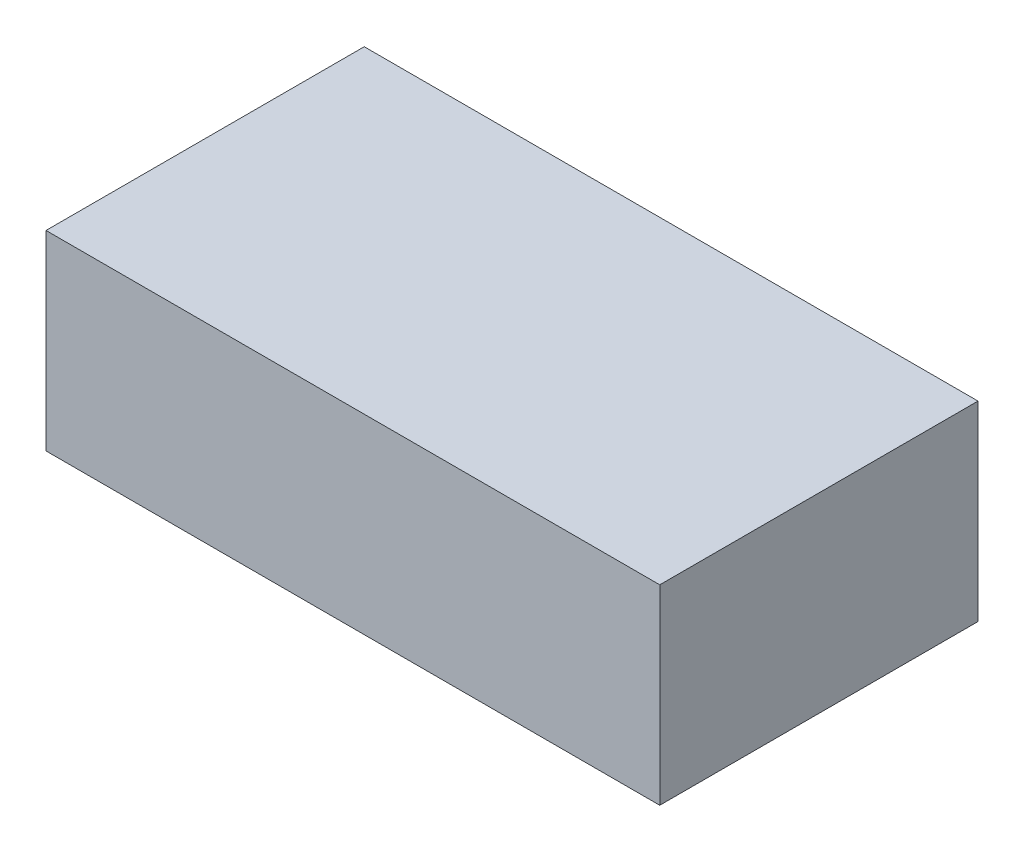
ISO-10303-21;
HEADER;
FILE_DESCRIPTION(('STEP AP214'),'2;1');
FILE_NAME('part.step','',(''),(''),'','','');
FILE_SCHEMA(('AUTOMOTIVE_DESIGN { 1 0 10303 214 1 1 1 1 }'));
ENDSEC;
DATA;
#1=APPLICATION_CONTEXT('core data for automotive mechanical design processes');
#2=APPLICATION_PROTOCOL_DEFINITION('international standard','automotive_design',2000,#1);
#3=PRODUCT_CONTEXT('',#1,'mechanical');
#4=PRODUCT('Part','Part','',(#3));
#5=PRODUCT_RELATED_PRODUCT_CATEGORY('part','',(#4));
#6=PRODUCT_DEFINITION_FORMATION('','',#4);
#7=PRODUCT_DEFINITION_CONTEXT('part definition',#1,'design');
#8=PRODUCT_DEFINITION('design','',#6,#7);
#9=PRODUCT_DEFINITION_SHAPE('','',#8);
#10=(LENGTH_UNIT() NAMED_UNIT(*) SI_UNIT(.MILLI.,.METRE.));
#11=(NAMED_UNIT(*) PLANE_ANGLE_UNIT() SI_UNIT($,.RADIAN.));
#12=(NAMED_UNIT(*) SI_UNIT($,.STERADIAN.) SOLID_ANGLE_UNIT());
#13=UNCERTAINTY_MEASURE_WITH_UNIT(LENGTH_MEASURE(1.E-05),#10,'distance_accuracy_value','');
#14=(GEOMETRIC_REPRESENTATION_CONTEXT(3) GLOBAL_UNCERTAINTY_ASSIGNED_CONTEXT((#13)) GLOBAL_UNIT_ASSIGNED_CONTEXT((#10,
#11,#12)) REPRESENTATION_CONTEXT('',''));
#15=CARTESIAN_POINT('',(0.,0.,0.));
#16=DIRECTION('',(0.,0.,1.));
#17=DIRECTION('',(1.,0.,0.));
#18=AXIS2_PLACEMENT_3D('',#15,#16,#17);
#19=CARTESIAN_POINT('',(0.67499992,-0.20999958,0.));
#20=DIRECTION('',(0.,-1.,0.));
#21=DIRECTION('',(-1.,0.,0.));
#22=AXIS2_PLACEMENT_3D('',#19,#20,#21);
#23=PLANE('',#22);
#24=DIRECTION('',(0.,0.,1.));
#25=VECTOR('',#24,1.);
#26=CARTESIAN_POINT('',(0.67499992,-0.20999958,0.));
#27=LINE('',#26,#25);
#28=CARTESIAN_POINT('',(0.67499992,-0.20999958,0.));
#29=VERTEX_POINT('',#28);
#30=CARTESIAN_POINT('',(0.67499992,-0.20999958,0.70000114));
#31=VERTEX_POINT('',#30);
#32=EDGE_CURVE('E11',#29,#31,#27,.T.);
#33=ORIENTED_EDGE('',*,*,#32,.T.);
#34=DIRECTION('',(-1.,0.,0.));
#35=VECTOR('',#34,1.);
#36=CARTESIAN_POINT('',(0.67499992,-0.20999958,0.70000114));
#37=LINE('',#36,#35);
#38=CARTESIAN_POINT('',(-0.67499992,-0.20999958,0.70000114));
#39=VERTEX_POINT('',#38);
#40=EDGE_CURVE('E24',#31,#39,#37,.T.);
#41=ORIENTED_EDGE('',*,*,#40,.T.);
#42=DIRECTION('',(0.,0.,1.));
#43=VECTOR('',#42,1.);
#44=CARTESIAN_POINT('',(-0.67499992,-0.20999958,0.));
#45=LINE('',#44,#43);
#46=CARTESIAN_POINT('',(-0.67499992,-0.20999958,0.));
#47=VERTEX_POINT('',#46);
#48=EDGE_CURVE('E85',#47,#39,#45,.T.);
#49=ORIENTED_EDGE('',*,*,#48,.F.);
#50=DIRECTION('',(-1.,0.,0.));
#51=VECTOR('',#50,1.);
#52=CARTESIAN_POINT('',(0.67499992,-0.20999958,0.));
#53=LINE('',#52,#51);
#54=EDGE_CURVE('E83',#29,#47,#53,.T.);
#55=ORIENTED_EDGE('',*,*,#54,.F.);
#56=EDGE_LOOP('',(#33,#41,#49,#55));
#57=FACE_BOUND('',#56,.T.);
#58=ADVANCED_FACE('F17',(#57),#23,.T.);
#59=CARTESIAN_POINT('',(-0.67499992,-0.20999958,0.));
#60=DIRECTION('',(-1.,0.,0.));
#61=DIRECTION('',(0.,1.,0.));
#62=AXIS2_PLACEMENT_3D('',#59,#60,#61);
#63=PLANE('',#62);
#64=ORIENTED_EDGE('',*,*,#48,.T.);
#65=DIRECTION('',(0.,1.,0.));
#66=VECTOR('',#65,1.);
#67=CARTESIAN_POINT('',(-0.67499992,-0.20999958,0.70000114));
#68=LINE('',#67,#66);
#69=CARTESIAN_POINT('',(-0.67499992,0.20999958,0.70000114));
#70=VERTEX_POINT('',#69);
#71=EDGE_CURVE('E81',#39,#70,#68,.T.);
#72=ORIENTED_EDGE('',*,*,#71,.T.);
#73=DIRECTION('',(0.,0.,1.));
#74=VECTOR('',#73,1.);
#75=CARTESIAN_POINT('',(-0.67499992,0.20999958,0.));
#76=LINE('',#75,#74);
#77=CARTESIAN_POINT('',(-0.67499992,0.20999958,0.));
#78=VERTEX_POINT('',#77);
#79=EDGE_CURVE('E79',#78,#70,#76,.T.);
#80=ORIENTED_EDGE('',*,*,#79,.F.);
#81=DIRECTION('',(0.,1.,0.));
#82=VECTOR('',#81,1.);
#83=CARTESIAN_POINT('',(-0.67499992,-0.20999958,0.));
#84=LINE('',#83,#82);
#85=EDGE_CURVE('E70',#47,#78,#84,.T.);
#86=ORIENTED_EDGE('',*,*,#85,.F.);
#87=EDGE_LOOP('',(#64,#72,#80,#86));
#88=FACE_BOUND('',#87,.T.);
#89=ADVANCED_FACE('F90',(#88),#63,.T.);
#90=CARTESIAN_POINT('',(-0.67499992,0.20999958,0.));
#91=DIRECTION('',(-1.88148170224543E-06,0.99999999999823,0.));
#92=DIRECTION('',(0.99999999999823,1.88148170224543E-06,0.));
#93=AXIS2_PLACEMENT_3D('',#90,#91,#92);
#94=PLANE('',#93);
#95=ORIENTED_EDGE('',*,*,#79,.T.);
#96=DIRECTION('',(0.99999999999823,1.88148170224543E-06,0.));
#97=VECTOR('',#96,1.);
#98=CARTESIAN_POINT('',(-0.67499992,0.20999958,0.70000114));
#99=LINE('',#98,#97);
#100=CARTESIAN_POINT('',(0.67499992,0.21000212,0.70000114));
#101=VERTEX_POINT('',#100);
#102=EDGE_CURVE('E60',#70,#101,#99,.T.);
#103=ORIENTED_EDGE('',*,*,#102,.T.);
#104=DIRECTION('',(0.,0.,1.));
#105=VECTOR('',#104,1.);
#106=CARTESIAN_POINT('',(0.67499992,0.21000212,0.));
#107=LINE('',#106,#105);
#108=CARTESIAN_POINT('',(0.67499992,0.21000212,0.));
#109=VERTEX_POINT('',#108);
#110=EDGE_CURVE('E54',#109,#101,#107,.T.);
#111=ORIENTED_EDGE('',*,*,#110,.F.);
#112=DIRECTION('',(0.99999999999823,1.88148170224543E-06,0.));
#113=VECTOR('',#112,1.);
#114=CARTESIAN_POINT('',(-0.67499992,0.20999958,0.));
#115=LINE('',#114,#113);
#116=EDGE_CURVE('E58',#78,#109,#115,.T.);
#117=ORIENTED_EDGE('',*,*,#116,.F.);
#118=EDGE_LOOP('',(#95,#103,#111,#117));
#119=FACE_BOUND('',#118,.T.);
#120=ADVANCED_FACE('F57',(#119),#94,.T.);
#121=CARTESIAN_POINT('',(0.67499992,0.21000212,0.));
#122=DIRECTION('',(1.,0.,0.));
#123=DIRECTION('',(0.,-1.,0.));
#124=AXIS2_PLACEMENT_3D('',#121,#122,#123);
#125=PLANE('',#124);
#126=ORIENTED_EDGE('',*,*,#110,.T.);
#127=DIRECTION('',(0.,-1.,0.));
#128=VECTOR('',#127,1.);
#129=CARTESIAN_POINT('',(0.67499992,0.21000212,0.70000114));
#130=LINE('',#129,#128);
#131=EDGE_CURVE('E71',#101,#31,#130,.T.);
#132=ORIENTED_EDGE('',*,*,#131,.T.);
#133=ORIENTED_EDGE('',*,*,#32,.F.);
#134=DIRECTION('',(0.,-1.,0.));
#135=VECTOR('',#134,1.);
#136=CARTESIAN_POINT('',(0.67499992,0.21000212,0.));
#137=LINE('',#136,#135);
#138=EDGE_CURVE('E68',#109,#29,#137,.T.);
#139=ORIENTED_EDGE('',*,*,#138,.F.);
#140=EDGE_LOOP('',(#126,#132,#133,#139));
#141=FACE_BOUND('',#140,.T.);
#142=ADVANCED_FACE('F73',(#141),#125,.T.);
#143=CARTESIAN_POINT('',(0.67499992,-0.20999958,0.));
#144=DIRECTION('',(0.,0.,1.));
#145=DIRECTION('',(1.,0.,0.));
#146=AXIS2_PLACEMENT_3D('',#143,#144,#145);
#147=PLANE('',#146);
#148=ORIENTED_EDGE('',*,*,#54,.T.);
#149=ORIENTED_EDGE('',*,*,#85,.T.);
#150=ORIENTED_EDGE('',*,*,#116,.T.);
#151=ORIENTED_EDGE('',*,*,#138,.T.);
#152=EDGE_LOOP('',(#148,#149,#150,#151));
#153=FACE_BOUND('',#152,.T.);
#154=ADVANCED_FACE('F67',(#153),#147,.F.);
#155=CARTESIAN_POINT('',(0.67499992,-0.20999958,0.70000114));
#156=DIRECTION('',(0.,0.,1.));
#157=DIRECTION('',(1.,0.,0.));
#158=AXIS2_PLACEMENT_3D('',#155,#156,#157);
#159=PLANE('',#158);
#160=ORIENTED_EDGE('',*,*,#131,.F.);
#161=ORIENTED_EDGE('',*,*,#102,.F.);
#162=ORIENTED_EDGE('',*,*,#71,.F.);
#163=ORIENTED_EDGE('',*,*,#40,.F.);
#164=EDGE_LOOP('',(#160,#161,#162,#163));
#165=FACE_BOUND('',#164,.T.);
#166=ADVANCED_FACE('F91',(#165),#159,.T.);
#167=CLOSED_SHELL('',(#58,#89,#120,#142,#154,#166));
#168=MANIFOLD_SOLID_BREP('B1',#167);
#169=ADVANCED_BREP_SHAPE_REPRESENTATION('',(#18,#168),#14);
#170=SHAPE_DEFINITION_REPRESENTATION(#9,#169);
ENDSEC;
END-ISO-10303-21;
